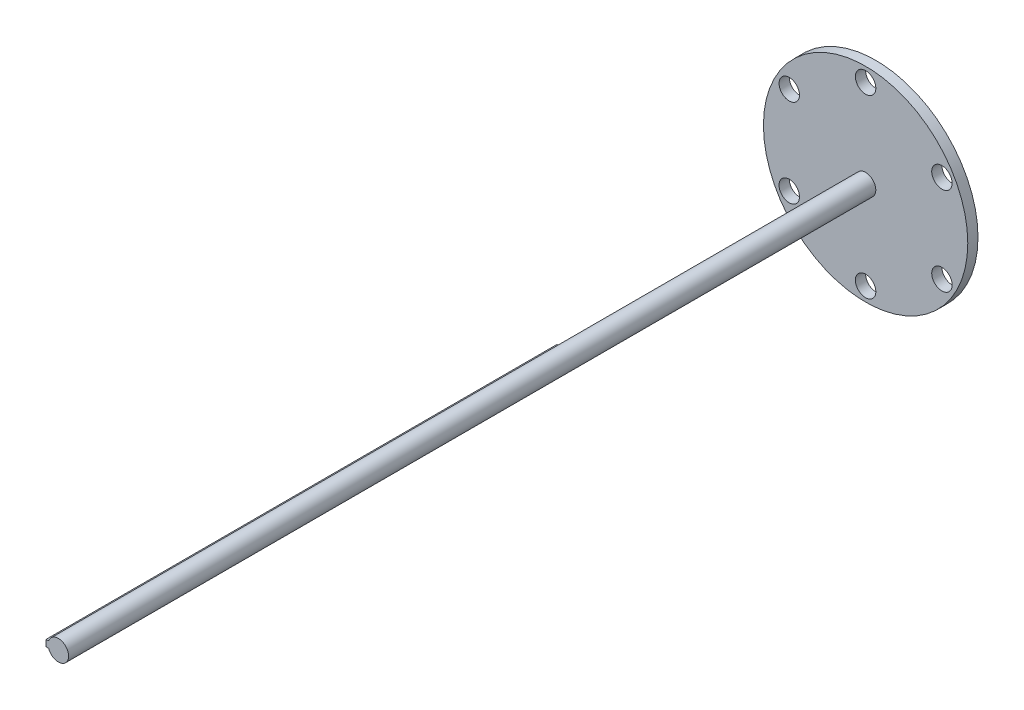
ISO-10303-21;
HEADER;
FILE_DESCRIPTION(('STEP AP214'),'2;1');
FILE_NAME('part.step','',(''),(''),'','','');
FILE_SCHEMA(('AUTOMOTIVE_DESIGN { 1 0 10303 214 1 1 1 1 }'));
ENDSEC;
DATA;
#1=APPLICATION_CONTEXT('core data for automotive mechanical design processes');
#2=APPLICATION_PROTOCOL_DEFINITION('international standard','automotive_design',2000,#1);
#3=PRODUCT_CONTEXT('',#1,'mechanical');
#4=PRODUCT('Part','Part','',(#3));
#5=PRODUCT_RELATED_PRODUCT_CATEGORY('part','',(#4));
#6=PRODUCT_DEFINITION_FORMATION('','',#4);
#7=PRODUCT_DEFINITION_CONTEXT('part definition',#1,'design');
#8=PRODUCT_DEFINITION('design','',#6,#7);
#9=PRODUCT_DEFINITION_SHAPE('','',#8);
#10=(LENGTH_UNIT() NAMED_UNIT(*) SI_UNIT(.MILLI.,.METRE.));
#11=(NAMED_UNIT(*) PLANE_ANGLE_UNIT() SI_UNIT($,.RADIAN.));
#12=(NAMED_UNIT(*) SI_UNIT($,.STERADIAN.) SOLID_ANGLE_UNIT());
#13=UNCERTAINTY_MEASURE_WITH_UNIT(LENGTH_MEASURE(1.E-05),#10,'distance_accuracy_value','');
#14=(GEOMETRIC_REPRESENTATION_CONTEXT(3) GLOBAL_UNCERTAINTY_ASSIGNED_CONTEXT((#13)) GLOBAL_UNIT_ASSIGNED_CONTEXT((#10,
#11,#12)) REPRESENTATION_CONTEXT('',''));
#15=CARTESIAN_POINT('',(0.,0.,0.));
#16=DIRECTION('',(0.,0.,1.));
#17=DIRECTION('',(1.,0.,0.));
#18=AXIS2_PLACEMENT_3D('',#15,#16,#17);
#19=CARTESIAN_POINT('',(0.,0.,160.));
#20=DIRECTION('',(0.,0.,-1.));
#21=DIRECTION('',(-1.,0.,0.));
#22=AXIS2_PLACEMENT_3D('',#19,#20,#21);
#23=CYLINDRICAL_SURFACE('',#22,2.);
#24=CARTESIAN_POINT('',(0.,0.,60.));
#25=DIRECTION('',(0.,0.,1.));
#26=DIRECTION('',(1.,0.,0.));
#27=AXIS2_PLACEMENT_3D('',#24,#25,#26);
#28=CIRCLE('',#27,2.);
#29=CARTESIAN_POINT('',(-1.89983551919633,0.625,60.));
#30=VERTEX_POINT('',#29);
#31=CARTESIAN_POINT('',(-1.89983551919633,-0.625,60.));
#32=VERTEX_POINT('',#31);
#33=EDGE_CURVE('E11',#30,#32,#28,.T.);
#34=ORIENTED_EDGE('',*,*,#33,.F.);
#35=DIRECTION('',(0.,0.,1.));
#36=VECTOR('',#35,1.);
#37=CARTESIAN_POINT('',(-1.89983551919633,0.625,60.));
#38=LINE('',#37,#36);
#39=CARTESIAN_POINT('',(-1.89983551919633,0.625,160.));
#40=VERTEX_POINT('',#39);
#41=EDGE_CURVE('E99',#30,#40,#38,.T.);
#42=ORIENTED_EDGE('',*,*,#41,.T.);
#43=CARTESIAN_POINT('',(0.,0.,160.));
#44=DIRECTION('',(0.,0.,1.));
#45=DIRECTION('',(1.,0.,0.));
#46=AXIS2_PLACEMENT_3D('',#43,#44,#45);
#47=CIRCLE('',#46,2.);
#48=CARTESIAN_POINT('',(-1.89983551919633,-0.625,160.));
#49=VERTEX_POINT('',#48);
#50=EDGE_CURVE('E98',#49,#40,#47,.T.);
#51=ORIENTED_EDGE('',*,*,#50,.F.);
#52=DIRECTION('',(0.,0.,1.));
#53=VECTOR('',#52,1.);
#54=CARTESIAN_POINT('',(-1.89983551919633,-0.625,60.));
#55=LINE('',#54,#53);
#56=EDGE_CURVE('E94',#32,#49,#55,.T.);
#57=ORIENTED_EDGE('',*,*,#56,.F.);
#58=EDGE_LOOP('',(#34,#42,#51,#57));
#59=FACE_BOUND('',#58,.T.);
#60=CARTESIAN_POINT('',(0.,0.,2.));
#61=DIRECTION('',(0.,0.,-1.));
#62=DIRECTION('',(-1.,0.,0.));
#63=AXIS2_PLACEMENT_3D('',#60,#61,#62);
#64=CIRCLE('',#63,2.);
#65=CARTESIAN_POINT('',(-2.,0.,2.));
#66=VERTEX_POINT('',#65);
#67=EDGE_CURVE('E46',#66,#66,#64,.T.);
#68=ORIENTED_EDGE('',*,*,#67,.F.);
#69=EDGE_LOOP('',(#68));
#70=FACE_BOUND('',#69,.T.);
#71=ADVANCED_FACE('F39',(#59,#70),#23,.T.);
#72=CARTESIAN_POINT('',(0.,0.,160.));
#73=DIRECTION('',(0.,0.,1.));
#74=DIRECTION('',(1.,0.,0.));
#75=AXIS2_PLACEMENT_3D('',#72,#73,#74);
#76=PLANE('',#75);
#77=ORIENTED_EDGE('',*,*,#50,.T.);
#78=DIRECTION('',(-1.,0.,0.));
#79=VECTOR('',#78,1.);
#80=CARTESIAN_POINT('',(-2.41983551919633,0.625,160.));
#81=LINE('',#80,#79);
#82=CARTESIAN_POINT('',(-2.41983551919633,0.625,160.));
#83=VERTEX_POINT('',#82);
#84=EDGE_CURVE('E360',#40,#83,#81,.T.);
#85=ORIENTED_EDGE('',*,*,#84,.T.);
#86=DIRECTION('',(0.,-1.,0.));
#87=VECTOR('',#86,1.);
#88=CARTESIAN_POINT('',(-2.41983551919633,0.,160.));
#89=LINE('',#88,#87);
#90=CARTESIAN_POINT('',(-2.41983551919633,-0.625,160.));
#91=VERTEX_POINT('',#90);
#92=EDGE_CURVE('E359',#83,#91,#89,.T.);
#93=ORIENTED_EDGE('',*,*,#92,.T.);
#94=DIRECTION('',(1.,0.,0.));
#95=VECTOR('',#94,1.);
#96=CARTESIAN_POINT('',(-2.41983551919633,-0.625,160.));
#97=LINE('',#96,#95);
#98=EDGE_CURVE('E53',#91,#49,#97,.T.);
#99=ORIENTED_EDGE('',*,*,#98,.T.);
#100=EDGE_LOOP('',(#77,#85,#93,#99));
#101=FACE_BOUND('',#100,.T.);
#102=ADVANCED_FACE('F153',(#101),#76,.T.);
#103=CARTESIAN_POINT('',(0.,0.,2.));
#104=DIRECTION('',(0.,0.,-1.));
#105=DIRECTION('',(-1.,0.,0.));
#106=AXIS2_PLACEMENT_3D('',#103,#104,#105);
#107=CYLINDRICAL_SURFACE('',#106,20.);
#108=CARTESIAN_POINT('',(0.,0.,2.));
#109=DIRECTION('',(0.,0.,-1.));
#110=DIRECTION('',(-1.,0.,0.));
#111=AXIS2_PLACEMENT_3D('',#108,#109,#110);
#112=CIRCLE('',#111,20.);
#113=CARTESIAN_POINT('',(-20.,0.,2.));
#114=VERTEX_POINT('',#113);
#115=EDGE_CURVE('E142',#114,#114,#112,.T.);
#116=ORIENTED_EDGE('',*,*,#115,.T.);
#117=EDGE_LOOP('',(#116));
#118=FACE_BOUND('',#117,.T.);
#119=CARTESIAN_POINT('',(0.,0.,0.));
#120=DIRECTION('',(0.,0.,-1.));
#121=DIRECTION('',(-1.,0.,0.));
#122=AXIS2_PLACEMENT_3D('',#119,#120,#121);
#123=CIRCLE('',#122,20.);
#124=CARTESIAN_POINT('',(-20.,0.,0.));
#125=VERTEX_POINT('',#124);
#126=EDGE_CURVE('E108',#125,#125,#123,.T.);
#127=ORIENTED_EDGE('',*,*,#126,.F.);
#128=EDGE_LOOP('',(#127));
#129=FACE_BOUND('',#128,.T.);
#130=ADVANCED_FACE('F157',(#118,#129),#107,.T.);
#131=CARTESIAN_POINT('',(0.,0.,2.));
#132=DIRECTION('',(0.,0.,-1.));
#133=DIRECTION('',(-1.,0.,0.));
#134=AXIS2_PLACEMENT_3D('',#131,#132,#133);
#135=PLANE('',#134);
#136=CARTESIAN_POINT('',(0.,17.25,2.));
#137=DIRECTION('',(0.,0.,-1.));
#138=DIRECTION('',(-1.,0.,0.));
#139=AXIS2_PLACEMENT_3D('',#136,#137,#138);
#140=CIRCLE('',#139,2.);
#141=CARTESIAN_POINT('',(-2.,17.25,2.));
#142=VERTEX_POINT('',#141);
#143=EDGE_CURVE('E105',#142,#142,#140,.T.);
#144=ORIENTED_EDGE('',*,*,#143,.T.);
#145=EDGE_LOOP('',(#144));
#146=FACE_BOUND('',#145,.T.);
#147=CARTESIAN_POINT('',(14.9389382152815,8.62500000000017,2.));
#148=DIRECTION('',(0.,0.,-1.));
#149=DIRECTION('',(-1.,0.,0.));
#150=AXIS2_PLACEMENT_3D('',#147,#148,#149);
#151=CIRCLE('',#150,2.);
#152=CARTESIAN_POINT('',(12.9389382152815,8.62500000000017,2.));
#153=VERTEX_POINT('',#152);
#154=EDGE_CURVE('E117',#153,#153,#151,.T.);
#155=ORIENTED_EDGE('',*,*,#154,.T.);
#156=EDGE_LOOP('',(#155));
#157=FACE_BOUND('',#156,.T.);
#158=CARTESIAN_POINT('',(14.9389382152816,-8.62499999999986,2.));
#159=DIRECTION('',(0.,0.,-1.));
#160=DIRECTION('',(-1.,0.,0.));
#161=AXIS2_PLACEMENT_3D('',#158,#159,#160);
#162=CIRCLE('',#161,2.);
#163=CARTESIAN_POINT('',(12.9389382152816,-8.62499999999986,2.));
#164=VERTEX_POINT('',#163);
#165=EDGE_CURVE('E116',#164,#164,#162,.T.);
#166=ORIENTED_EDGE('',*,*,#165,.T.);
#167=EDGE_LOOP('',(#166));
#168=FACE_BOUND('',#167,.T.);
#169=CARTESIAN_POINT('',(1.20456106190088E-13,-17.25,2.));
#170=DIRECTION('',(0.,0.,-1.));
#171=DIRECTION('',(-1.,0.,0.));
#172=AXIS2_PLACEMENT_3D('',#169,#170,#171);
#173=CIRCLE('',#172,2.);
#174=CARTESIAN_POINT('',(-1.99999999999988,-17.25,2.));
#175=VERTEX_POINT('',#174);
#176=EDGE_CURVE('E134',#175,#175,#173,.T.);
#177=ORIENTED_EDGE('',*,*,#176,.T.);
#178=EDGE_LOOP('',(#177));
#179=FACE_BOUND('',#178,.T.);
#180=CARTESIAN_POINT('',(-14.9389382152815,-8.62500000000007,2.));
#181=DIRECTION('',(0.,0.,-1.));
#182=DIRECTION('',(-1.,0.,0.));
#183=AXIS2_PLACEMENT_3D('',#180,#181,#182);
#184=CIRCLE('',#183,2.);
#185=CARTESIAN_POINT('',(-16.9389382152815,-8.62500000000007,2.));
#186=VERTEX_POINT('',#185);
#187=EDGE_CURVE('E128',#186,#186,#184,.T.);
#188=ORIENTED_EDGE('',*,*,#187,.T.);
#189=EDGE_LOOP('',(#188));
#190=FACE_BOUND('',#189,.T.);
#191=CARTESIAN_POINT('',(-14.9389382152816,8.62499999999997,2.));
#192=DIRECTION('',(0.,0.,-1.));
#193=DIRECTION('',(-1.,0.,0.));
#194=AXIS2_PLACEMENT_3D('',#191,#192,#193);
#195=CIRCLE('',#194,2.);
#196=CARTESIAN_POINT('',(-16.9389382152816,8.62499999999997,2.));
#197=VERTEX_POINT('',#196);
#198=EDGE_CURVE('E122',#197,#197,#195,.T.);
#199=ORIENTED_EDGE('',*,*,#198,.T.);
#200=EDGE_LOOP('',(#199));
#201=FACE_BOUND('',#200,.T.);
#202=ORIENTED_EDGE('',*,*,#67,.T.);
#203=EDGE_LOOP('',(#202));
#204=FACE_BOUND('',#203,.T.);
#205=ORIENTED_EDGE('',*,*,#115,.F.);
#206=EDGE_LOOP('',(#205));
#207=FACE_BOUND('',#206,.T.);
#208=ADVANCED_FACE('F150',(#146,#157,#168,#179,#190,#201,#204,#207),#135,.F.);
#209=CARTESIAN_POINT('',(0.,0.,0.));
#210=DIRECTION('',(0.,0.,1.));
#211=DIRECTION('',(1.,0.,0.));
#212=AXIS2_PLACEMENT_3D('',#209,#210,#211);
#213=PLANE('',#212);
#214=CARTESIAN_POINT('',(0.,17.25,0.));
#215=DIRECTION('',(0.,0.,-1.));
#216=DIRECTION('',(-1.,0.,0.));
#217=AXIS2_PLACEMENT_3D('',#214,#215,#216);
#218=CIRCLE('',#217,2.);
#219=CARTESIAN_POINT('',(-2.,17.25,0.));
#220=VERTEX_POINT('',#219);
#221=EDGE_CURVE('E109',#220,#220,#218,.T.);
#222=ORIENTED_EDGE('',*,*,#221,.F.);
#223=EDGE_LOOP('',(#222));
#224=FACE_BOUND('',#223,.T.);
#225=CARTESIAN_POINT('',(14.9389382152815,8.62500000000017,0.));
#226=DIRECTION('',(0.,0.,-1.));
#227=DIRECTION('',(-1.,0.,0.));
#228=AXIS2_PLACEMENT_3D('',#225,#226,#227);
#229=CIRCLE('',#228,2.);
#230=CARTESIAN_POINT('',(12.9389382152815,8.62500000000017,0.));
#231=VERTEX_POINT('',#230);
#232=EDGE_CURVE('E113',#231,#231,#229,.T.);
#233=ORIENTED_EDGE('',*,*,#232,.F.);
#234=EDGE_LOOP('',(#233));
#235=FACE_BOUND('',#234,.T.);
#236=CARTESIAN_POINT('',(14.9389382152816,-8.62499999999986,0.));
#237=DIRECTION('',(0.,0.,-1.));
#238=DIRECTION('',(-1.,0.,0.));
#239=AXIS2_PLACEMENT_3D('',#236,#237,#238);
#240=CIRCLE('',#239,2.);
#241=CARTESIAN_POINT('',(12.9389382152816,-8.62499999999986,0.));
#242=VERTEX_POINT('',#241);
#243=EDGE_CURVE('E137',#242,#242,#240,.T.);
#244=ORIENTED_EDGE('',*,*,#243,.F.);
#245=EDGE_LOOP('',(#244));
#246=FACE_BOUND('',#245,.T.);
#247=CARTESIAN_POINT('',(1.20456106190088E-13,-17.25,0.));
#248=DIRECTION('',(0.,0.,-1.));
#249=DIRECTION('',(-1.,0.,0.));
#250=AXIS2_PLACEMENT_3D('',#247,#248,#249);
#251=CIRCLE('',#250,2.);
#252=CARTESIAN_POINT('',(-1.99999999999988,-17.25,0.));
#253=VERTEX_POINT('',#252);
#254=EDGE_CURVE('E131',#253,#253,#251,.T.);
#255=ORIENTED_EDGE('',*,*,#254,.F.);
#256=EDGE_LOOP('',(#255));
#257=FACE_BOUND('',#256,.T.);
#258=CARTESIAN_POINT('',(-14.9389382152815,-8.62500000000007,0.));
#259=DIRECTION('',(0.,0.,-1.));
#260=DIRECTION('',(-1.,0.,0.));
#261=AXIS2_PLACEMENT_3D('',#258,#259,#260);
#262=CIRCLE('',#261,2.);
#263=CARTESIAN_POINT('',(-16.9389382152815,-8.62500000000007,0.));
#264=VERTEX_POINT('',#263);
#265=EDGE_CURVE('E125',#264,#264,#262,.T.);
#266=ORIENTED_EDGE('',*,*,#265,.F.);
#267=EDGE_LOOP('',(#266));
#268=FACE_BOUND('',#267,.T.);
#269=CARTESIAN_POINT('',(-14.9389382152816,8.62499999999997,0.));
#270=DIRECTION('',(0.,0.,-1.));
#271=DIRECTION('',(-1.,0.,0.));
#272=AXIS2_PLACEMENT_3D('',#269,#270,#271);
#273=CIRCLE('',#272,2.);
#274=CARTESIAN_POINT('',(-16.9389382152816,8.62499999999997,0.));
#275=VERTEX_POINT('',#274);
#276=EDGE_CURVE('E112',#275,#275,#273,.T.);
#277=ORIENTED_EDGE('',*,*,#276,.F.);
#278=EDGE_LOOP('',(#277));
#279=FACE_BOUND('',#278,.T.);
#280=ORIENTED_EDGE('',*,*,#126,.T.);
#281=EDGE_LOOP('',(#280));
#282=FACE_BOUND('',#281,.T.);
#283=ADVANCED_FACE('F165',(#224,#235,#246,#257,#268,#279,#282),#213,.F.);
#284=CARTESIAN_POINT('',(-14.9389382152816,8.62499999999997,2.));
#285=DIRECTION('',(0.,0.,-1.));
#286=DIRECTION('',(-1.,0.,0.));
#287=AXIS2_PLACEMENT_3D('',#284,#285,#286);
#288=CYLINDRICAL_SURFACE('',#287,2.);
#289=ORIENTED_EDGE('',*,*,#198,.F.);
#290=EDGE_LOOP('',(#289));
#291=FACE_BOUND('',#290,.T.);
#292=ORIENTED_EDGE('',*,*,#276,.T.);
#293=EDGE_LOOP('',(#292));
#294=FACE_BOUND('',#293,.T.);
#295=ADVANCED_FACE('F167',(#291,#294),#288,.F.);
#296=CARTESIAN_POINT('',(-14.9389382152815,-8.62500000000007,2.));
#297=DIRECTION('',(0.,0.,-1.));
#298=DIRECTION('',(-1.,0.,0.));
#299=AXIS2_PLACEMENT_3D('',#296,#297,#298);
#300=CYLINDRICAL_SURFACE('',#299,2.);
#301=ORIENTED_EDGE('',*,*,#187,.F.);
#302=EDGE_LOOP('',(#301));
#303=FACE_BOUND('',#302,.T.);
#304=ORIENTED_EDGE('',*,*,#265,.T.);
#305=EDGE_LOOP('',(#304));
#306=FACE_BOUND('',#305,.T.);
#307=ADVANCED_FACE('F173',(#303,#306),#300,.F.);
#308=CARTESIAN_POINT('',(1.20456106190088E-13,-17.25,2.));
#309=DIRECTION('',(0.,0.,-1.));
#310=DIRECTION('',(-1.,0.,0.));
#311=AXIS2_PLACEMENT_3D('',#308,#309,#310);
#312=CYLINDRICAL_SURFACE('',#311,2.);
#313=ORIENTED_EDGE('',*,*,#176,.F.);
#314=EDGE_LOOP('',(#313));
#315=FACE_BOUND('',#314,.T.);
#316=ORIENTED_EDGE('',*,*,#254,.T.);
#317=EDGE_LOOP('',(#316));
#318=FACE_BOUND('',#317,.T.);
#319=ADVANCED_FACE('F194',(#315,#318),#312,.F.);
#320=CARTESIAN_POINT('',(14.9389382152816,-8.62499999999986,2.));
#321=DIRECTION('',(0.,0.,-1.));
#322=DIRECTION('',(-1.,0.,0.));
#323=AXIS2_PLACEMENT_3D('',#320,#321,#322);
#324=CYLINDRICAL_SURFACE('',#323,2.);
#325=ORIENTED_EDGE('',*,*,#165,.F.);
#326=EDGE_LOOP('',(#325));
#327=FACE_BOUND('',#326,.T.);
#328=ORIENTED_EDGE('',*,*,#243,.T.);
#329=EDGE_LOOP('',(#328));
#330=FACE_BOUND('',#329,.T.);
#331=ADVANCED_FACE('F200',(#327,#330),#324,.F.);
#332=CARTESIAN_POINT('',(14.9389382152815,8.62500000000017,2.));
#333=DIRECTION('',(0.,0.,-1.));
#334=DIRECTION('',(-1.,0.,0.));
#335=AXIS2_PLACEMENT_3D('',#332,#333,#334);
#336=CYLINDRICAL_SURFACE('',#335,2.);
#337=ORIENTED_EDGE('',*,*,#154,.F.);
#338=EDGE_LOOP('',(#337));
#339=FACE_BOUND('',#338,.T.);
#340=ORIENTED_EDGE('',*,*,#232,.T.);
#341=EDGE_LOOP('',(#340));
#342=FACE_BOUND('',#341,.T.);
#343=ADVANCED_FACE('F207',(#339,#342),#336,.F.);
#344=CARTESIAN_POINT('',(0.,17.25,2.));
#345=DIRECTION('',(0.,0.,-1.));
#346=DIRECTION('',(-1.,0.,0.));
#347=AXIS2_PLACEMENT_3D('',#344,#345,#346);
#348=CYLINDRICAL_SURFACE('',#347,2.);
#349=ORIENTED_EDGE('',*,*,#143,.F.);
#350=EDGE_LOOP('',(#349));
#351=FACE_BOUND('',#350,.T.);
#352=ORIENTED_EDGE('',*,*,#221,.T.);
#353=EDGE_LOOP('',(#352));
#354=FACE_BOUND('',#353,.T.);
#355=ADVANCED_FACE('F212',(#351,#354),#348,.F.);
#356=CARTESIAN_POINT('',(-2.41983551919633,0.,60.));
#357=DIRECTION('',(-1.,0.,0.));
#358=DIRECTION('',(0.,0.,1.));
#359=AXIS2_PLACEMENT_3D('',#356,#357,#358);
#360=PLANE('',#359);
#361=ORIENTED_EDGE('',*,*,#92,.F.);
#362=DIRECTION('',(0.,0.,1.));
#363=VECTOR('',#362,1.);
#364=CARTESIAN_POINT('',(-2.41983551919633,0.625,60.));
#365=LINE('',#364,#363);
#366=CARTESIAN_POINT('',(-2.41983551919633,0.625,60.));
#367=VERTEX_POINT('',#366);
#368=EDGE_CURVE('E78',#367,#83,#365,.T.);
#369=ORIENTED_EDGE('',*,*,#368,.F.);
#370=DIRECTION('',(0.,-1.,0.));
#371=VECTOR('',#370,1.);
#372=CARTESIAN_POINT('',(-2.41983551919633,0.,60.));
#373=LINE('',#372,#371);
#374=CARTESIAN_POINT('',(-2.41983551919633,-0.625,60.));
#375=VERTEX_POINT('',#374);
#376=EDGE_CURVE('E62',#367,#375,#373,.T.);
#377=ORIENTED_EDGE('',*,*,#376,.T.);
#378=DIRECTION('',(0.,0.,1.));
#379=VECTOR('',#378,1.);
#380=CARTESIAN_POINT('',(-2.41983551919633,-0.625,60.));
#381=LINE('',#380,#379);
#382=EDGE_CURVE('E85',#375,#91,#381,.T.);
#383=ORIENTED_EDGE('',*,*,#382,.T.);
#384=EDGE_LOOP('',(#361,#369,#377,#383));
#385=FACE_BOUND('',#384,.T.);
#386=ADVANCED_FACE('F226',(#385),#360,.T.);
#387=CARTESIAN_POINT('',(-2.41983551919633,0.625,60.));
#388=DIRECTION('',(0.,1.,0.));
#389=DIRECTION('',(0.,0.,1.));
#390=AXIS2_PLACEMENT_3D('',#387,#388,#389);
#391=PLANE('',#390);
#392=ORIENTED_EDGE('',*,*,#84,.F.);
#393=ORIENTED_EDGE('',*,*,#41,.F.);
#394=DIRECTION('',(-1.,0.,0.));
#395=VECTOR('',#394,1.);
#396=CARTESIAN_POINT('',(-2.41983551919633,0.625,60.));
#397=LINE('',#396,#395);
#398=EDGE_CURVE('E89',#30,#367,#397,.T.);
#399=ORIENTED_EDGE('',*,*,#398,.T.);
#400=ORIENTED_EDGE('',*,*,#368,.T.);
#401=EDGE_LOOP('',(#392,#393,#399,#400));
#402=FACE_BOUND('',#401,.T.);
#403=ADVANCED_FACE('F234',(#402),#391,.T.);
#404=CARTESIAN_POINT('',(-2.41983551919633,-0.625,60.));
#405=DIRECTION('',(0.,-1.,0.));
#406=DIRECTION('',(0.,0.,-1.));
#407=AXIS2_PLACEMENT_3D('',#404,#405,#406);
#408=PLANE('',#407);
#409=ORIENTED_EDGE('',*,*,#98,.F.);
#410=ORIENTED_EDGE('',*,*,#382,.F.);
#411=DIRECTION('',(1.,0.,0.));
#412=VECTOR('',#411,1.);
#413=CARTESIAN_POINT('',(-2.41983551919633,-0.625,60.));
#414=LINE('',#413,#412);
#415=EDGE_CURVE('E88',#375,#32,#414,.T.);
#416=ORIENTED_EDGE('',*,*,#415,.T.);
#417=ORIENTED_EDGE('',*,*,#56,.T.);
#418=EDGE_LOOP('',(#409,#410,#416,#417));
#419=FACE_BOUND('',#418,.T.);
#420=ADVANCED_FACE('F93',(#419),#408,.T.);
#421=CARTESIAN_POINT('',(0.,0.,60.));
#422=DIRECTION('',(0.,0.,1.));
#423=DIRECTION('',(1.,0.,0.));
#424=AXIS2_PLACEMENT_3D('',#421,#422,#423);
#425=PLANE('',#424);
#426=ORIENTED_EDGE('',*,*,#398,.F.);
#427=ORIENTED_EDGE('',*,*,#33,.T.);
#428=ORIENTED_EDGE('',*,*,#415,.F.);
#429=ORIENTED_EDGE('',*,*,#376,.F.);
#430=EDGE_LOOP('',(#426,#427,#428,#429));
#431=FACE_BOUND('',#430,.T.);
#432=ADVANCED_FACE('F87',(#431),#425,.F.);
#433=CLOSED_SHELL('',(#71,#102,#130,#208,#283,#295,#307,#319,#331,#343,#355,#386,#403,#420,#432));
#434=MANIFOLD_SOLID_BREP('B2',#433);
#435=ADVANCED_BREP_SHAPE_REPRESENTATION('',(#18,#434),#14);
#436=SHAPE_DEFINITION_REPRESENTATION(#9,#435);
ENDSEC;
END-ISO-10303-21;
